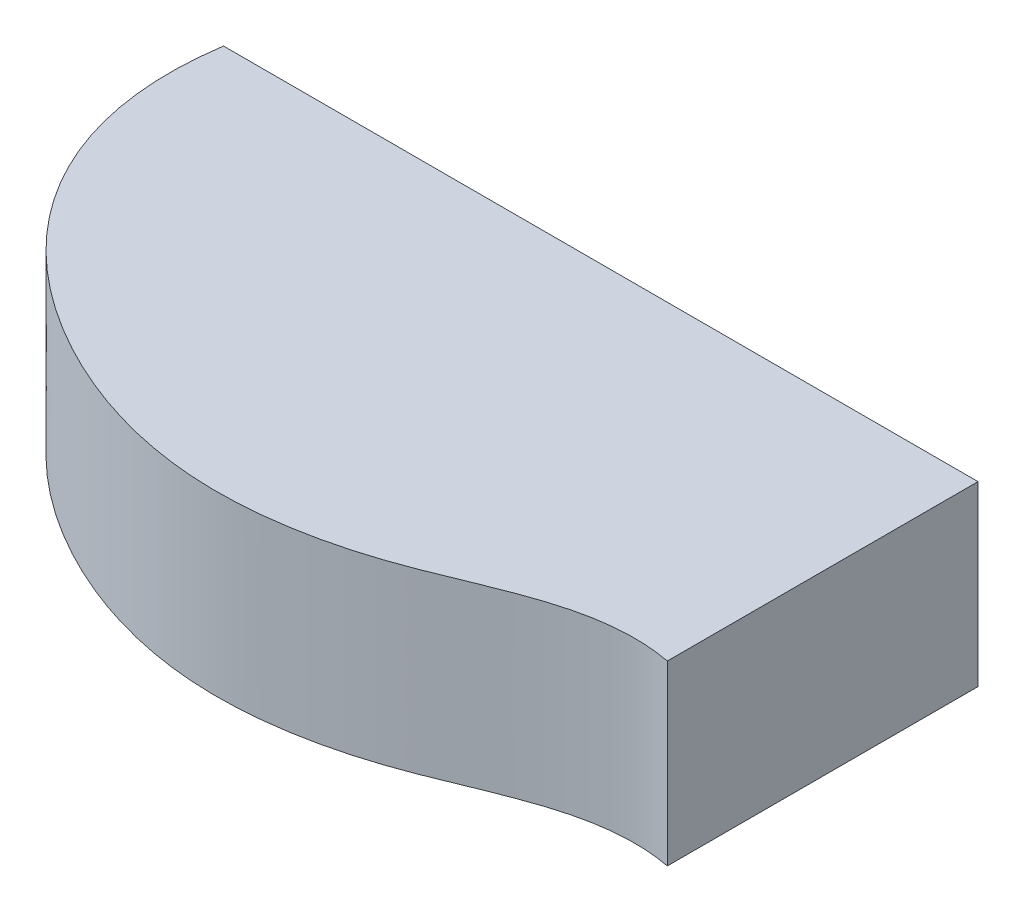
ISO-10303-21;
HEADER;
FILE_DESCRIPTION(('STEP AP214'),'2;1');
FILE_NAME('part.step','',(''),(''),'','','');
FILE_SCHEMA(('AUTOMOTIVE_DESIGN { 1 0 10303 214 1 1 1 1 }'));
ENDSEC;
DATA;
#1=APPLICATION_CONTEXT('core data for automotive mechanical design processes');
#2=APPLICATION_PROTOCOL_DEFINITION('international standard','automotive_design',2000,#1);
#3=PRODUCT_CONTEXT('',#1,'mechanical');
#4=PRODUCT('Part','Part','',(#3));
#5=PRODUCT_RELATED_PRODUCT_CATEGORY('part','',(#4));
#6=PRODUCT_DEFINITION_FORMATION('','',#4);
#7=PRODUCT_DEFINITION_CONTEXT('part definition',#1,'design');
#8=PRODUCT_DEFINITION('design','',#6,#7);
#9=PRODUCT_DEFINITION_SHAPE('','',#8);
#10=(LENGTH_UNIT() NAMED_UNIT(*) SI_UNIT(.MILLI.,.METRE.));
#11=(NAMED_UNIT(*) PLANE_ANGLE_UNIT() SI_UNIT($,.RADIAN.));
#12=(NAMED_UNIT(*) SI_UNIT($,.STERADIAN.) SOLID_ANGLE_UNIT());
#13=UNCERTAINTY_MEASURE_WITH_UNIT(LENGTH_MEASURE(1.E-05),#10,'distance_accuracy_value','');
#14=(GEOMETRIC_REPRESENTATION_CONTEXT(3) GLOBAL_UNCERTAINTY_ASSIGNED_CONTEXT((#13)) GLOBAL_UNIT_ASSIGNED_CONTEXT((#10,
#11,#12)) REPRESENTATION_CONTEXT('',''));
#15=CARTESIAN_POINT('',(0.,0.,0.));
#16=DIRECTION('',(0.,0.,1.));
#17=DIRECTION('',(1.,0.,0.));
#18=AXIS2_PLACEMENT_3D('',#15,#16,#17);
#19=CARTESIAN_POINT('',(-105.134910031732,-22.225,3.175));
#20=DIRECTION('',(0.,0.,1.));
#21=DIRECTION('',(1.,0.,0.));
#22=AXIS2_PLACEMENT_3D('',#19,#20,#21);
#23=PLANE('',#22);
#24=DIRECTION('',(1.,0.,0.));
#25=VECTOR('',#24,1.);
#26=CARTESIAN_POINT('',(-6.35,-21.14,3.17500000000001));
#27=LINE('',#26,#25);
#28=CARTESIAN_POINT('',(-71.35,-21.14,3.17500000000001));
#29=VERTEX_POINT('',#28);
#30=CARTESIAN_POINT('',(-6.35,-21.14,3.17500000000001));
#31=VERTEX_POINT('',#30);
#32=EDGE_CURVE('E174',#29,#31,#27,.T.);
#33=ORIENTED_EDGE('',*,*,#32,.F.);
#34=DIRECTION('',(0.,1.,0.));
#35=VECTOR('',#34,1.);
#36=CARTESIAN_POINT('',(-71.35,-21.14,3.17500000000001));
#37=LINE('',#36,#35);
#38=CARTESIAN_POINT('',(-71.35,0.,3.17500000000001));
#39=VERTEX_POINT('',#38);
#40=EDGE_CURVE('E191',#29,#39,#37,.T.);
#41=ORIENTED_EDGE('',*,*,#40,.T.);
#42=DIRECTION('',(-1.,0.,0.));
#43=VECTOR('',#42,1.);
#44=CARTESIAN_POINT('',(-69.0254483131704,0.,3.175));
#45=LINE('',#44,#43);
#46=CARTESIAN_POINT('',(-101.959910031732,0.,3.175));
#47=VERTEX_POINT('',#46);
#48=EDGE_CURVE('E315',#39,#47,#45,.T.);
#49=ORIENTED_EDGE('',*,*,#48,.T.);
#50=DIRECTION('',(0.,-1.,0.));
#51=VECTOR('',#50,1.);
#52=CARTESIAN_POINT('',(-101.959910031732,1.651,3.175));
#53=LINE('',#52,#51);
#54=CARTESIAN_POINT('',(-101.959910031732,-22.225,3.175));
#55=VERTEX_POINT('',#54);
#56=EDGE_CURVE('E222',#55,#47,#53,.F.);
#57=ORIENTED_EDGE('',*,*,#56,.F.);
#58=DIRECTION('',(1.,0.,0.));
#59=VECTOR('',#58,1.);
#60=CARTESIAN_POINT('',(-105.134910031732,-22.225,3.175));
#61=LINE('',#60,#59);
#62=CARTESIAN_POINT('',(-6.34999999999999,-22.225,3.17500000000001));
#63=VERTEX_POINT('',#62);
#64=EDGE_CURVE('E226',#55,#63,#61,.T.);
#65=ORIENTED_EDGE('',*,*,#64,.T.);
#66=DIRECTION('',(0.,-1.,0.));
#67=VECTOR('',#66,1.);
#68=CARTESIAN_POINT('',(-6.35,1.651,3.17500000000001));
#69=LINE('',#68,#67);
#70=EDGE_CURVE('E209',#31,#63,#69,.T.);
#71=ORIENTED_EDGE('',*,*,#70,.F.);
#72=EDGE_LOOP('',(#33,#41,#49,#57,#65,#71));
#73=FACE_BOUND('',#72,.T.);
#74=ADVANCED_FACE('F67',(#73),#23,.T.);
#75=CARTESIAN_POINT('',(-69.0254483131705,0.,53.3840091627392));
#76=DIRECTION('',(0.,-1.,0.));
#77=DIRECTION('',(0.,0.,-1.));
#78=AXIS2_PLACEMENT_3D('',#75,#76,#77);
#79=PLANE('',#78);
#80=DIRECTION('',(-1.,0.,0.));
#81=VECTOR('',#80,1.);
#82=CARTESIAN_POINT('',(-6.35,0.,38.675));
#83=LINE('',#82,#81);
#84=CARTESIAN_POINT('',(-6.35,0.,38.675));
#85=VERTEX_POINT('',#84);
#86=CARTESIAN_POINT('',(-71.35,0.,38.675));
#87=VERTEX_POINT('',#86);
#88=EDGE_CURVE('E328',#85,#87,#83,.T.);
#89=ORIENTED_EDGE('',*,*,#88,.F.);
#90=DIRECTION('',(0.,0.,1.));
#91=VECTOR('',#90,1.);
#92=CARTESIAN_POINT('',(-6.35,0.,3.17500000000001));
#93=LINE('',#92,#91);
#94=CARTESIAN_POINT('',(-6.35,0.,3.17500000000001));
#95=VERTEX_POINT('',#94);
#96=EDGE_CURVE('E181',#95,#85,#93,.T.);
#97=ORIENTED_EDGE('',*,*,#96,.F.);
#98=CARTESIAN_POINT('',(-3.175,0.,3.17500000000001));
#99=DIRECTION('',(0.,-1.,0.));
#100=DIRECTION('',(0.,0.,-1.));
#101=AXIS2_PLACEMENT_3D('',#98,#99,#100);
#102=CIRCLE('',#101,3.175);
#103=CARTESIAN_POINT('',(-3.17499999999999,0.,6.35000000000001));
#104=VERTEX_POINT('',#103);
#105=EDGE_CURVE('E76',#104,#95,#102,.T.);
#106=ORIENTED_EDGE('',*,*,#105,.F.);
#107=DIRECTION('',(0.,0.,-1.));
#108=VECTOR('',#107,1.);
#109=CARTESIAN_POINT('',(-3.17499999999984,0.,53.384009162739));
#110=LINE('',#109,#108);
#111=CARTESIAN_POINT('',(-3.17499999999989,0.,37.6768133420675));
#112=VERTEX_POINT('',#111);
#113=EDGE_CURVE('E309',#112,#104,#110,.T.);
#114=ORIENTED_EDGE('',*,*,#113,.F.);
#115=CARTESIAN_POINT('',(-3.17499999999989,0.,40.8518133420675));
#116=DIRECTION('',(0.,-1.,0.));
#117=DIRECTION('',(0.,0.,-1.));
#118=AXIS2_PLACEMENT_3D('',#115,#116,#117);
#119=CIRCLE('',#118,3.17500000000001);
#120=CARTESIAN_POINT('',(-6.34967632277289,0.,40.8064785251548));
#121=VERTEX_POINT('',#120);
#122=EDGE_CURVE('E12',#121,#112,#119,.T.);
#123=ORIENTED_EDGE('',*,*,#122,.F.);
#124=CARTESIAN_POINT('',(-3.17499999999989,0.,40.8518133420675));
#125=CARTESIAN_POINT('',(-3.9812415552864,0.,40.7992368263425));
#126=CARTESIAN_POINT('',(-5.61317367744924,0.,40.7580711209545));
#127=CARTESIAN_POINT('',(-8.75590748353557,0.,40.9183399402929));
#128=CARTESIAN_POINT('',(-12.5449663773382,0.,41.5150783019261));
#129=CARTESIAN_POINT('',(-16.8589920441475,0.,42.6928889945275));
#130=CARTESIAN_POINT('',(-22.3650502453555,0.,44.6567199529698));
#131=CARTESIAN_POINT('',(-27.6074988486592,0.,46.9042811851703));
#132=CARTESIAN_POINT('',(-32.7425469293154,0.,48.8822106065741));
#133=CARTESIAN_POINT('',(-37.9236159978043,0.,50.5440339746701));
#134=CARTESIAN_POINT('',(-44.5766862537404,0.,52.0309701827406));
#135=CARTESIAN_POINT('',(-52.639871625642,0.,52.729404253394));
#136=CARTESIAN_POINT('',(-60.6254084908129,0.,52.2008203498105));
#137=CARTESIAN_POINT('',(-68.5133074447219,0.,50.4217112020834));
#138=CARTESIAN_POINT('',(-76.1367016489203,0.,47.5347385661934));
#139=CARTESIAN_POINT('',(-83.3535877969591,0.,43.6609357543328));
#140=CARTESIAN_POINT('',(-89.925307122152,0.,38.9368374323127));
#141=CARTESIAN_POINT('',(-95.6094870801536,0.,33.3908448924856));
#142=CARTESIAN_POINT('',(-100.196904726243,0.,27.060690394246));
#143=CARTESIAN_POINT('',(-102.946013068647,0.,21.1454932319141));
#144=CARTESIAN_POINT('',(-104.407943919798,0.,16.0165117731742));
#145=CARTESIAN_POINT('',(-105.110198278143,0.,11.9658509141963));
#146=CARTESIAN_POINT('',(-105.34299843683,0.,8.40765697552305));
#147=CARTESIAN_POINT('',(-105.303439387585,0.,5.46128013975902));
#148=CARTESIAN_POINT('',(-105.203482374383,0.,3.93083329096136));
#149=CARTESIAN_POINT('',(-105.134910031732,0.,3.175));
#150=B_SPLINE_CURVE_WITH_KNOTS('',3,(#124,#125,#126,#127,#128,#129,#130,#131,#132,#133,#134,
#135,#136,#137,#138,#139,#140,#141,#142,#143,#144,#145,#146,#147,#148,#149),.UNSPECIFIED.,.F.,
.F.,(4,1,1,1,1,1,1,1,1,1,1,1,1,1,1,1,1,1,1,1,1,1,1,4),(0.0173980938278673,0.0323975116569982,
0.0473969294861293,0.0773957651443912,0.107394600802653,0.137393436460915,0.197391107777439,
0.227389943435701,0.257388779093963,0.317386450410487,0.377384121727011,0.437381793043535,
0.497379464360059,0.557377135676583,0.617374806993106,0.67737247830963,0.737370149626154,
0.797367820942678,0.857365492259202,0.887364327917464,0.917363163575726,0.947361999233988,
0.962361417063119,0.97736083489225),.UNSPECIFIED.);
#151=CARTESIAN_POINT('',(-105.30984179488,0.,6.34517726290527));
#152=VERTEX_POINT('',#151);
#153=EDGE_CURVE('E303',#152,#121,#150,.F.);
#154=ORIENTED_EDGE('',*,*,#153,.F.);
#155=CARTESIAN_POINT('',(-105.134910031732,0.,3.175));
#156=DIRECTION('',(0.,-1.,0.));
#157=DIRECTION('',(0.,0.,-1.));
#158=AXIS2_PLACEMENT_3D('',#155,#156,#157);
#159=CIRCLE('',#158,3.17499999999998);
#160=EDGE_CURVE('E318',#47,#152,#159,.T.);
#161=ORIENTED_EDGE('',*,*,#160,.F.);
#162=ORIENTED_EDGE('',*,*,#48,.F.);
#163=DIRECTION('',(0.,0.,-1.));
#164=VECTOR('',#163,1.);
#165=CARTESIAN_POINT('',(-71.35,0.,3.17500000000001));
#166=LINE('',#165,#164);
#167=EDGE_CURVE('E177',#87,#39,#166,.T.);
#168=ORIENTED_EDGE('',*,*,#167,.F.);
#169=EDGE_LOOP('',(#89,#97,#106,#114,#123,#154,#161,#162,#168));
#170=FACE_BOUND('',#169,.T.);
#171=ADVANCED_FACE('F257',(#170),#79,.T.);
#172=CARTESIAN_POINT('',(0.,3.175,0.));
#173=DIRECTION('',(0.,0.,1.));
#174=DIRECTION('',(1.,0.,0.));
#175=AXIS2_PLACEMENT_3D('',#172,#173,#174);
#176=PLANE('',#175);
#177=DIRECTION('',(0.,-1.,0.));
#178=VECTOR('',#177,1.);
#179=CARTESIAN_POINT('',(0.,3.175,0.));
#180=LINE('',#179,#178);
#181=CARTESIAN_POINT('',(0.,3.175,0.));
#182=VERTEX_POINT('',#181);
#183=CARTESIAN_POINT('',(0.,-22.225,0.));
#184=VERTEX_POINT('',#183);
#185=EDGE_CURVE('E292',#182,#184,#180,.T.);
#186=ORIENTED_EDGE('',*,*,#185,.T.);
#187=DIRECTION('',(1.,0.,0.));
#188=VECTOR('',#187,1.);
#189=CARTESIAN_POINT('',(-107.95,-22.225,0.));
#190=LINE('',#189,#188);
#191=CARTESIAN_POINT('',(-107.95,-22.225,0.));
#192=VERTEX_POINT('',#191);
#193=EDGE_CURVE('E238',#192,#184,#190,.T.);
#194=ORIENTED_EDGE('',*,*,#193,.F.);
#195=DIRECTION('',(0.,-1.,0.));
#196=VECTOR('',#195,1.);
#197=CARTESIAN_POINT('',(-107.95,3.175,0.));
#198=LINE('',#197,#196);
#199=CARTESIAN_POINT('',(-107.95,3.175,0.));
#200=VERTEX_POINT('',#199);
#201=EDGE_CURVE('E300',#200,#192,#198,.T.);
#202=ORIENTED_EDGE('',*,*,#201,.F.);
#203=DIRECTION('',(-1.,0.,0.));
#204=VECTOR('',#203,1.);
#205=CARTESIAN_POINT('',(0.,3.175,0.));
#206=LINE('',#205,#204);
#207=EDGE_CURVE('E284',#182,#200,#206,.T.);
#208=ORIENTED_EDGE('',*,*,#207,.F.);
#209=EDGE_LOOP('',(#186,#194,#202,#208));
#210=FACE_BOUND('',#209,.T.);
#211=ADVANCED_FACE('F69',(#210),#176,.F.);
#212=CARTESIAN_POINT('',(-107.95,3.175,0.));
#213=CARTESIAN_POINT('',(-111.264371580734,3.175,22.2233551649082));
#214=CARTESIAN_POINT('',(-93.1283093555666,3.175,45.9760409533743));
#215=CARTESIAN_POINT('',(-57.6096224916778,3.175,57.6977874502621));
#216=CARTESIAN_POINT('',(-28.7253065343009,3.175,52.8458822420178));
#217=CARTESIAN_POINT('',(-11.8195118326116,3.175,42.2096880656384));
#218=CARTESIAN_POINT('',(0.,3.175,44.45));
#219=B_SPLINE_CURVE_WITH_KNOTS('',3,(#212,#213,#214,#215,#216,#217,#218),.UNSPECIFIED.,.F.,.F.,
(4,1,1,1,4),(0.,0.396763779291097,0.585186103696538,0.766934877819502,1.),.UNSPECIFIED.);
#220=DIRECTION('',(0.,-1.,0.));
#221=VECTOR('',#220,1.);
#222=SURFACE_OF_LINEAR_EXTRUSION('',#219,#221);
#223=CARTESIAN_POINT('',(-107.95,-22.225,0.));
#224=CARTESIAN_POINT('',(-111.264371580734,-22.225,22.2233551649083));
#225=CARTESIAN_POINT('',(-93.1283093555666,-22.225,45.9760409533742));
#226=CARTESIAN_POINT('',(-57.6096224916778,-22.225,57.6977874502621));
#227=CARTESIAN_POINT('',(-28.7253065343009,-22.225,52.8458822420178));
#228=CARTESIAN_POINT('',(-11.8195118326116,-22.225,42.2096880656384));
#229=CARTESIAN_POINT('',(0.,-22.225,44.45));
#230=B_SPLINE_CURVE_WITH_KNOTS('',3,(#223,#224,#225,#226,#227,#228,#229),.UNSPECIFIED.,.F.,.F.,
(4,1,1,1,4),(0.,0.396763779291097,0.585186103696538,0.766934877819502,1.),.UNSPECIFIED.);
#231=CARTESIAN_POINT('',(0.,-22.225,44.45));
#232=VERTEX_POINT('',#231);
#233=EDGE_CURVE('E351',#192,#232,#230,.T.);
#234=ORIENTED_EDGE('',*,*,#233,.T.);
#235=DIRECTION('',(0.,-1.,0.));
#236=VECTOR('',#235,1.);
#237=CARTESIAN_POINT('',(0.,3.175,44.45));
#238=LINE('',#237,#236);
#239=CARTESIAN_POINT('',(0.,3.175,44.45));
#240=VERTEX_POINT('',#239);
#241=EDGE_CURVE('E296',#240,#232,#238,.T.);
#242=ORIENTED_EDGE('',*,*,#241,.F.);
#243=EDGE_CURVE('E276',#200,#240,#219,.T.);
#244=ORIENTED_EDGE('',*,*,#243,.F.);
#245=ORIENTED_EDGE('',*,*,#201,.T.);
#246=EDGE_LOOP('',(#234,#242,#244,#245));
#247=FACE_BOUND('',#246,.T.);
#248=ADVANCED_FACE('F271',(#247),#222,.F.);
#249=CARTESIAN_POINT('',(0.,3.175,0.));
#250=DIRECTION('',(1.,0.,0.));
#251=DIRECTION('',(0.,0.,-1.));
#252=AXIS2_PLACEMENT_3D('',#249,#250,#251);
#253=PLANE('',#252);
#254=ORIENTED_EDGE('',*,*,#241,.T.);
#255=DIRECTION('',(0.,0.,1.));
#256=VECTOR('',#255,1.);
#257=CARTESIAN_POINT('',(0.,-22.225,0.));
#258=LINE('',#257,#256);
#259=EDGE_CURVE('E349',#184,#232,#258,.T.);
#260=ORIENTED_EDGE('',*,*,#259,.F.);
#261=ORIENTED_EDGE('',*,*,#185,.F.);
#262=DIRECTION('',(0.,0.,1.));
#263=VECTOR('',#262,1.);
#264=CARTESIAN_POINT('',(0.,3.175,0.));
#265=LINE('',#264,#263);
#266=EDGE_CURVE('E283',#182,#240,#265,.T.);
#267=ORIENTED_EDGE('',*,*,#266,.T.);
#268=EDGE_LOOP('',(#254,#260,#261,#267));
#269=FACE_BOUND('',#268,.T.);
#270=ADVANCED_FACE('F265',(#269),#253,.T.);
#271=CARTESIAN_POINT('',(-69.0254483131705,3.175,53.3840091627392));
#272=DIRECTION('',(0.,-1.,0.));
#273=DIRECTION('',(0.,0.,-1.));
#274=AXIS2_PLACEMENT_3D('',#271,#272,#273);
#275=PLANE('',#274);
#276=ORIENTED_EDGE('',*,*,#207,.T.);
#277=ORIENTED_EDGE('',*,*,#243,.T.);
#278=ORIENTED_EDGE('',*,*,#266,.F.);
#279=EDGE_LOOP('',(#276,#277,#278));
#280=FACE_BOUND('',#279,.T.);
#281=ADVANCED_FACE('F261',(#280),#275,.F.);
#282=CARTESIAN_POINT('',(-69.0254483131704,-22.225,53.3840091627392));
#283=DIRECTION('',(0.,-1.,0.));
#284=DIRECTION('',(0.,0.,-1.));
#285=AXIS2_PLACEMENT_3D('',#282,#283,#284);
#286=PLANE('',#285);
#287=ORIENTED_EDGE('',*,*,#259,.T.);
#288=ORIENTED_EDGE('',*,*,#233,.F.);
#289=ORIENTED_EDGE('',*,*,#193,.T.);
#290=EDGE_LOOP('',(#287,#288,#289));
#291=FACE_BOUND('',#290,.T.);
#292=CARTESIAN_POINT('',(-3.17499999999989,-22.225,40.8518133420675));
#293=DIRECTION('',(0.,-1.,0.));
#294=DIRECTION('',(0.,0.,-1.));
#295=AXIS2_PLACEMENT_3D('',#292,#293,#294);
#296=CIRCLE('',#295,3.17500000000001);
#297=CARTESIAN_POINT('',(-6.34967632277289,-22.225,40.8064785251548));
#298=VERTEX_POINT('',#297);
#299=CARTESIAN_POINT('',(-3.1749999999999,-22.225,37.6768133420675));
#300=VERTEX_POINT('',#299);
#301=EDGE_CURVE('E184',#298,#300,#296,.T.);
#302=ORIENTED_EDGE('',*,*,#301,.T.);
#303=DIRECTION('',(0.,0.,1.));
#304=VECTOR('',#303,1.);
#305=CARTESIAN_POINT('',(-3.175,-22.225,3.17500000000001));
#306=LINE('',#305,#304);
#307=CARTESIAN_POINT('',(-3.17499999999999,-22.225,6.35000000000001));
#308=VERTEX_POINT('',#307);
#309=EDGE_CURVE('E91',#308,#300,#306,.T.);
#310=ORIENTED_EDGE('',*,*,#309,.F.);
#311=CARTESIAN_POINT('',(-3.175,-22.225,3.17500000000001));
#312=DIRECTION('',(0.,-1.,0.));
#313=DIRECTION('',(0.,0.,-1.));
#314=AXIS2_PLACEMENT_3D('',#311,#312,#313);
#315=CIRCLE('',#314,3.175);
#316=EDGE_CURVE('E201',#308,#63,#315,.T.);
#317=ORIENTED_EDGE('',*,*,#316,.T.);
#318=ORIENTED_EDGE('',*,*,#64,.F.);
#319=CARTESIAN_POINT('',(-105.134910031732,-22.225,3.175));
#320=DIRECTION('',(0.,-1.,0.));
#321=DIRECTION('',(0.,0.,-1.));
#322=AXIS2_PLACEMENT_3D('',#319,#320,#321);
#323=CIRCLE('',#322,3.17499999999998);
#324=CARTESIAN_POINT('',(-105.30984179488,-22.225,6.34517726290528));
#325=VERTEX_POINT('',#324);
#326=EDGE_CURVE('E214',#55,#325,#323,.T.);
#327=ORIENTED_EDGE('',*,*,#326,.T.);
#328=CARTESIAN_POINT('',(-3.17499999999989,-22.225,40.8518133420675));
#329=CARTESIAN_POINT('',(-3.9812415552864,-22.225,40.7992368263425));
#330=CARTESIAN_POINT('',(-5.61317367744924,-22.225,40.7580711209545));
#331=CARTESIAN_POINT('',(-8.75590748353557,-22.225,40.9183399402929));
#332=CARTESIAN_POINT('',(-12.5449663773382,-22.225,41.5150783019261));
#333=CARTESIAN_POINT('',(-16.8589920441475,-22.225,42.6928889945275));
#334=CARTESIAN_POINT('',(-22.3650502453555,-22.225,44.6567199529698));
#335=CARTESIAN_POINT('',(-27.6074988486592,-22.225,46.9042811851703));
#336=CARTESIAN_POINT('',(-32.7425469293154,-22.225,48.8822106065741));
#337=CARTESIAN_POINT('',(-37.9236159978043,-22.225,50.5440339746701));
#338=CARTESIAN_POINT('',(-44.5766862537404,-22.225,52.0309701827406));
#339=CARTESIAN_POINT('',(-52.639871625642,-22.225,52.729404253394));
#340=CARTESIAN_POINT('',(-60.6254084908129,-22.225,52.2008203498105));
#341=CARTESIAN_POINT('',(-68.5133074447219,-22.225,50.4217112020834));
#342=CARTESIAN_POINT('',(-76.1367016489203,-22.225,47.5347385661934));
#343=CARTESIAN_POINT('',(-83.3535877969591,-22.225,43.6609357543328));
#344=CARTESIAN_POINT('',(-89.925307122152,-22.225,38.9368374323127));
#345=CARTESIAN_POINT('',(-95.6094870801536,-22.225,33.3908448924856));
#346=CARTESIAN_POINT('',(-100.196904726243,-22.225,27.060690394246));
#347=CARTESIAN_POINT('',(-102.946013068647,-22.225,21.1454932319141));
#348=CARTESIAN_POINT('',(-104.407943919798,-22.225,16.0165117731742));
#349=CARTESIAN_POINT('',(-105.110198278143,-22.225,11.9658509141963));
#350=CARTESIAN_POINT('',(-105.34299843683,-22.225,8.40765697552305));
#351=CARTESIAN_POINT('',(-105.303439387585,-22.225,5.46128013975902));
#352=CARTESIAN_POINT('',(-105.203482374383,-22.225,3.93083329096136));
#353=CARTESIAN_POINT('',(-105.134910031732,-22.225,3.175));
#354=B_SPLINE_CURVE_WITH_KNOTS('',3,(#328,#329,#330,#331,#332,#333,#334,#335,#336,#337,#338,
#339,#340,#341,#342,#343,#344,#345,#346,#347,#348,#349,#350,#351,#352,#353),.UNSPECIFIED.,.F.,
.F.,(4,1,1,1,1,1,1,1,1,1,1,1,1,1,1,1,1,1,1,1,1,1,1,4),(0.0173980938278673,0.0323975116569982,
0.0473969294861293,0.0773957651443912,0.107394600802653,0.137393436460915,0.197391107777439,
0.227389943435701,0.257388779093963,0.317386450410487,0.377384121727011,0.437381793043535,
0.497379464360059,0.557377135676583,0.617374806993106,0.67737247830963,0.737370149626154,
0.797367820942678,0.857365492259202,0.887364327917464,0.917363163575726,0.947361999233988,
0.962361417063119,0.97736083489225),.UNSPECIFIED.);
#355=EDGE_CURVE('E232',#298,#325,#354,.T.);
#356=ORIENTED_EDGE('',*,*,#355,.F.);
#357=EDGE_LOOP('',(#302,#310,#317,#318,#327,#356));
#358=FACE_BOUND('',#357,.T.);
#359=ADVANCED_FACE('F254',(#291,#358),#286,.T.);
#360=CARTESIAN_POINT('',(-3.175,-22.225,3.17500000000001));
#361=DIRECTION('',(-1.,0.,0.));
#362=DIRECTION('',(0.,0.,1.));
#363=AXIS2_PLACEMENT_3D('',#360,#361,#362);
#364=PLANE('',#363);
#365=DIRECTION('',(0.,-1.,0.));
#366=VECTOR('',#365,1.);
#367=CARTESIAN_POINT('',(-3.1749999999999,1.651,37.6768133420675));
#368=LINE('',#367,#366);
#369=EDGE_CURVE('E198',#112,#300,#368,.T.);
#370=ORIENTED_EDGE('',*,*,#369,.F.);
#371=ORIENTED_EDGE('',*,*,#113,.T.);
#372=DIRECTION('',(0.,-1.,0.));
#373=VECTOR('',#372,1.);
#374=CARTESIAN_POINT('',(-3.17499999999999,1.651,6.35000000000001));
#375=LINE('',#374,#373);
#376=EDGE_CURVE('E205',#308,#104,#375,.F.);
#377=ORIENTED_EDGE('',*,*,#376,.F.);
#378=ORIENTED_EDGE('',*,*,#309,.T.);
#379=EDGE_LOOP('',(#370,#371,#377,#378));
#380=FACE_BOUND('',#379,.T.);
#381=ADVANCED_FACE('F249',(#380),#364,.T.);
#382=DIRECTION('',(0.,1.,0.));
#383=VECTOR('',#382,1.);
#384=SURFACE_OF_LINEAR_EXTRUSION('',#354,#383);
#385=DIRECTION('',(0.,1.,0.));
#386=VECTOR('',#385,1.);
#387=CARTESIAN_POINT('',(-6.34967632277289,-22.225,40.8064785251548));
#388=LINE('',#387,#386);
#389=EDGE_CURVE('E189',#298,#121,#388,.T.);
#390=ORIENTED_EDGE('',*,*,#389,.F.);
#391=ORIENTED_EDGE('',*,*,#355,.T.);
#392=DIRECTION('',(0.,1.,0.));
#393=VECTOR('',#392,1.);
#394=CARTESIAN_POINT('',(-105.30984179488,-22.225,6.34517726290528));
#395=LINE('',#394,#393);
#396=EDGE_CURVE('E218',#152,#325,#395,.F.);
#397=ORIENTED_EDGE('',*,*,#396,.F.);
#398=ORIENTED_EDGE('',*,*,#153,.T.);
#399=EDGE_LOOP('',(#390,#391,#397,#398));
#400=FACE_BOUND('',#399,.T.);
#401=ADVANCED_FACE('F244',(#400),#384,.T.);
#402=CARTESIAN_POINT('',(-105.134910031732,1.651,3.175));
#403=DIRECTION('',(0.,-1.,0.));
#404=DIRECTION('',(0.,0.,-1.));
#405=AXIS2_PLACEMENT_3D('',#402,#403,#404);
#406=CYLINDRICAL_SURFACE('',#405,3.17499999999998);
#407=ORIENTED_EDGE('',*,*,#326,.F.);
#408=ORIENTED_EDGE('',*,*,#56,.T.);
#409=ORIENTED_EDGE('',*,*,#160,.T.);
#410=ORIENTED_EDGE('',*,*,#396,.T.);
#411=EDGE_LOOP('',(#407,#408,#409,#410));
#412=FACE_BOUND('',#411,.T.);
#413=ADVANCED_FACE('F248',(#412),#406,.T.);
#414=CARTESIAN_POINT('',(-3.175,1.651,3.17500000000001));
#415=DIRECTION('',(0.,-1.,0.));
#416=DIRECTION('',(0.,0.,-1.));
#417=AXIS2_PLACEMENT_3D('',#414,#415,#416);
#418=CYLINDRICAL_SURFACE('',#417,3.175);
#419=ORIENTED_EDGE('',*,*,#105,.T.);
#420=EDGE_CURVE('E210',#95,#31,#69,.T.);
#421=ORIENTED_EDGE('',*,*,#420,.T.);
#422=ORIENTED_EDGE('',*,*,#70,.T.);
#423=ORIENTED_EDGE('',*,*,#316,.F.);
#424=ORIENTED_EDGE('',*,*,#376,.T.);
#425=EDGE_LOOP('',(#419,#421,#422,#423,#424));
#426=FACE_BOUND('',#425,.T.);
#427=ADVANCED_FACE('F325',(#426),#418,.T.);
#428=CARTESIAN_POINT('',(-3.17499999999989,1.651,40.8518133420675));
#429=DIRECTION('',(0.,-1.,0.));
#430=DIRECTION('',(0.,0.,-1.));
#431=AXIS2_PLACEMENT_3D('',#428,#429,#430);
#432=CYLINDRICAL_SURFACE('',#431,3.17500000000001);
#433=ORIENTED_EDGE('',*,*,#122,.T.);
#434=ORIENTED_EDGE('',*,*,#369,.T.);
#435=ORIENTED_EDGE('',*,*,#301,.F.);
#436=ORIENTED_EDGE('',*,*,#389,.T.);
#437=EDGE_LOOP('',(#433,#434,#435,#436));
#438=FACE_BOUND('',#437,.T.);
#439=ADVANCED_FACE('F367',(#438),#432,.T.);
#440=CARTESIAN_POINT('',(-6.35,-21.14,3.17500000000001));
#441=DIRECTION('',(-1.,0.,0.));
#442=DIRECTION('',(0.,0.,1.));
#443=AXIS2_PLACEMENT_3D('',#440,#441,#442);
#444=PLANE('',#443);
#445=ORIENTED_EDGE('',*,*,#96,.T.);
#446=DIRECTION('',(0.,1.,0.));
#447=VECTOR('',#446,1.);
#448=CARTESIAN_POINT('',(-6.35,-21.14,38.675));
#449=LINE('',#448,#447);
#450=CARTESIAN_POINT('',(-6.35,-21.14,38.675));
#451=VERTEX_POINT('',#450);
#452=EDGE_CURVE('E163',#451,#85,#449,.T.);
#453=ORIENTED_EDGE('',*,*,#452,.F.);
#454=DIRECTION('',(0.,0.,1.));
#455=VECTOR('',#454,1.);
#456=CARTESIAN_POINT('',(-6.35,-21.14,3.17500000000001));
#457=LINE('',#456,#455);
#458=EDGE_CURVE('E83',#31,#451,#457,.T.);
#459=ORIENTED_EDGE('',*,*,#458,.F.);
#460=ORIENTED_EDGE('',*,*,#420,.F.);
#461=EDGE_LOOP('',(#445,#453,#459,#460));
#462=FACE_BOUND('',#461,.T.);
#463=ADVANCED_FACE('F179',(#462),#444,.F.);
#464=CARTESIAN_POINT('',(-6.35,-21.14,38.675));
#465=DIRECTION('',(0.,0.,-1.));
#466=DIRECTION('',(-1.,0.,0.));
#467=AXIS2_PLACEMENT_3D('',#464,#465,#466);
#468=PLANE('',#467);
#469=ORIENTED_EDGE('',*,*,#88,.T.);
#470=DIRECTION('',(0.,1.,0.));
#471=VECTOR('',#470,1.);
#472=CARTESIAN_POINT('',(-71.35,-21.14,38.675));
#473=LINE('',#472,#471);
#474=CARTESIAN_POINT('',(-71.35,-21.14,38.675));
#475=VERTEX_POINT('',#474);
#476=EDGE_CURVE('E166',#475,#87,#473,.T.);
#477=ORIENTED_EDGE('',*,*,#476,.F.);
#478=DIRECTION('',(-1.,0.,0.));
#479=VECTOR('',#478,1.);
#480=CARTESIAN_POINT('',(-6.35,-21.14,38.675));
#481=LINE('',#480,#479);
#482=EDGE_CURVE('E161',#451,#475,#481,.T.);
#483=ORIENTED_EDGE('',*,*,#482,.F.);
#484=ORIENTED_EDGE('',*,*,#452,.T.);
#485=EDGE_LOOP('',(#469,#477,#483,#484));
#486=FACE_BOUND('',#485,.T.);
#487=ADVANCED_FACE('F162',(#486),#468,.F.);
#488=CARTESIAN_POINT('',(-71.35,-21.14,3.17500000000001));
#489=DIRECTION('',(1.,0.,0.));
#490=DIRECTION('',(0.,0.,-1.));
#491=AXIS2_PLACEMENT_3D('',#488,#489,#490);
#492=PLANE('',#491);
#493=ORIENTED_EDGE('',*,*,#167,.T.);
#494=ORIENTED_EDGE('',*,*,#40,.F.);
#495=DIRECTION('',(0.,0.,-1.));
#496=VECTOR('',#495,1.);
#497=CARTESIAN_POINT('',(-71.35,-21.14,3.17500000000001));
#498=LINE('',#497,#496);
#499=EDGE_CURVE('E170',#475,#29,#498,.T.);
#500=ORIENTED_EDGE('',*,*,#499,.F.);
#501=ORIENTED_EDGE('',*,*,#476,.T.);
#502=EDGE_LOOP('',(#493,#494,#500,#501));
#503=FACE_BOUND('',#502,.T.);
#504=ADVANCED_FACE('F344',(#503),#492,.F.);
#505=CARTESIAN_POINT('',(0.,-21.14,0.));
#506=DIRECTION('',(0.,-1.,0.));
#507=DIRECTION('',(0.,0.,-1.));
#508=AXIS2_PLACEMENT_3D('',#505,#506,#507);
#509=PLANE('',#508);
#510=ORIENTED_EDGE('',*,*,#458,.T.);
#511=ORIENTED_EDGE('',*,*,#482,.T.);
#512=ORIENTED_EDGE('',*,*,#499,.T.);
#513=ORIENTED_EDGE('',*,*,#32,.T.);
#514=EDGE_LOOP('',(#510,#511,#512,#513));
#515=FACE_BOUND('',#514,.T.);
#516=ADVANCED_FACE('F172',(#515),#509,.T.);
#517=CLOSED_SHELL('',(#74,#171,#211,#248,#270,#281,#359,#381,#401,#413,#427,#439,#463,#487,#504,#516));
#518=MANIFOLD_SOLID_BREP('B2',#517);
#519=ADVANCED_BREP_SHAPE_REPRESENTATION('',(#18,#518),#14);
#520=SHAPE_DEFINITION_REPRESENTATION(#9,#519);
ENDSEC;
END-ISO-10303-21;
